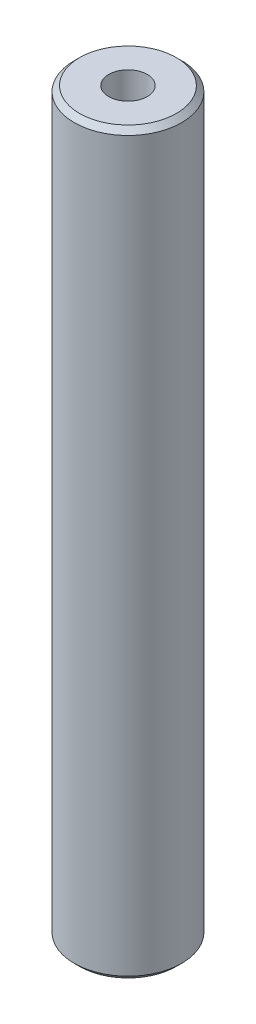
ISO-10303-21;
HEADER;
FILE_DESCRIPTION(('STEP AP214'),'2;1');
FILE_NAME('part.step','',(''),(''),'','','');
FILE_SCHEMA(('AUTOMOTIVE_DESIGN { 1 0 10303 214 1 1 1 1 }'));
ENDSEC;
DATA;
#1=APPLICATION_CONTEXT('core data for automotive mechanical design processes');
#2=APPLICATION_PROTOCOL_DEFINITION('international standard','automotive_design',2000,#1);
#3=PRODUCT_CONTEXT('',#1,'mechanical');
#4=PRODUCT('Part','Part','',(#3));
#5=PRODUCT_RELATED_PRODUCT_CATEGORY('part','',(#4));
#6=PRODUCT_DEFINITION_FORMATION('','',#4);
#7=PRODUCT_DEFINITION_CONTEXT('part definition',#1,'design');
#8=PRODUCT_DEFINITION('design','',#6,#7);
#9=PRODUCT_DEFINITION_SHAPE('','',#8);
#10=(LENGTH_UNIT() NAMED_UNIT(*) SI_UNIT(.MILLI.,.METRE.));
#11=(NAMED_UNIT(*) PLANE_ANGLE_UNIT() SI_UNIT($,.RADIAN.));
#12=(NAMED_UNIT(*) SI_UNIT($,.STERADIAN.) SOLID_ANGLE_UNIT());
#13=UNCERTAINTY_MEASURE_WITH_UNIT(LENGTH_MEASURE(1.E-05),#10,'distance_accuracy_value','');
#14=(GEOMETRIC_REPRESENTATION_CONTEXT(3) GLOBAL_UNCERTAINTY_ASSIGNED_CONTEXT((#13)) GLOBAL_UNIT_ASSIGNED_CONTEXT((#10,
#11,#12)) REPRESENTATION_CONTEXT('',''));
#15=CARTESIAN_POINT('',(0.,0.,0.));
#16=DIRECTION('',(0.,0.,1.));
#17=DIRECTION('',(1.,0.,0.));
#18=AXIS2_PLACEMENT_3D('',#15,#16,#17);
#19=CARTESIAN_POINT('',(0.,240.65770032879,0.));
#20=DIRECTION('',(0.,-1.,0.));
#21=DIRECTION('',(0.,0.,-1.));
#22=AXIS2_PLACEMENT_3D('',#19,#20,#21);
#23=CYLINDRICAL_SURFACE('',#22,17.5);
#24=CARTESIAN_POINT('',(0.,238.927523134323,0.));
#25=DIRECTION('',(0.,1.,0.));
#26=DIRECTION('',(0.,0.,1.));
#27=AXIS2_PLACEMENT_3D('',#24,#25,#26);
#28=CIRCLE('',#27,17.5);
#29=CARTESIAN_POINT('',(0.,238.927523134323,17.5));
#30=VERTEX_POINT('',#29);
#31=EDGE_CURVE('E50',#30,#30,#28,.F.);
#32=ORIENTED_EDGE('',*,*,#31,.T.);
#33=EDGE_LOOP('',(#32));
#34=FACE_BOUND('',#33,.T.);
#35=CARTESIAN_POINT('',(0.,1.73017719446747,0.));
#36=DIRECTION('',(0.,1.,0.));
#37=DIRECTION('',(0.,0.,1.));
#38=AXIS2_PLACEMENT_3D('',#35,#36,#37);
#39=CIRCLE('',#38,17.5);
#40=CARTESIAN_POINT('',(0.,1.73017719446747,17.5));
#41=VERTEX_POINT('',#40);
#42=EDGE_CURVE('E51',#41,#41,#39,.T.);
#43=ORIENTED_EDGE('',*,*,#42,.T.);
#44=EDGE_LOOP('',(#43));
#45=FACE_BOUND('',#44,.T.);
#46=ADVANCED_FACE('F39',(#34,#45),#23,.T.);
#47=CARTESIAN_POINT('',(0.,240.65770032879,0.));
#48=DIRECTION('',(0.,1.,0.));
#49=DIRECTION('',(0.,0.,1.));
#50=AXIS2_PLACEMENT_3D('',#47,#48,#49);
#51=PLANE('',#50);
#52=CARTESIAN_POINT('',(0.,240.65770032879,0.));
#53=DIRECTION('',(0.,1.,0.));
#54=DIRECTION('',(0.,0.,1.));
#55=AXIS2_PLACEMENT_3D('',#52,#53,#54);
#56=CIRCLE('',#55,15.7698228055325);
#57=CARTESIAN_POINT('',(0.,240.65770032879,15.7698228055325));
#58=VERTEX_POINT('',#57);
#59=EDGE_CURVE('E54',#58,#58,#56,.T.);
#60=ORIENTED_EDGE('',*,*,#59,.T.);
#61=EDGE_LOOP('',(#60));
#62=FACE_BOUND('',#61,.T.);
#63=CARTESIAN_POINT('',(0.,240.65770032879,0.));
#64=DIRECTION('',(0.,1.,0.));
#65=DIRECTION('',(0.,0.,1.));
#66=AXIS2_PLACEMENT_3D('',#63,#64,#65);
#67=CIRCLE('',#66,6.27814500208501);
#68=CARTESIAN_POINT('',(0.,240.65770032879,6.27814500208501));
#69=VERTEX_POINT('',#68);
#70=EDGE_CURVE('E58',#69,#69,#67,.T.);
#71=ORIENTED_EDGE('',*,*,#70,.F.);
#72=EDGE_LOOP('',(#71));
#73=FACE_BOUND('',#72,.T.);
#74=ADVANCED_FACE('F69',(#62,#73),#51,.T.);
#75=CARTESIAN_POINT('',(0.,0.,0.));
#76=DIRECTION('',(0.,1.,0.));
#77=DIRECTION('',(0.,0.,1.));
#78=AXIS2_PLACEMENT_3D('',#75,#76,#77);
#79=PLANE('',#78);
#80=CARTESIAN_POINT('',(0.,0.,0.));
#81=DIRECTION('',(0.,1.,0.));
#82=DIRECTION('',(0.,0.,1.));
#83=AXIS2_PLACEMENT_3D('',#80,#81,#82);
#84=CIRCLE('',#83,15.7698228055325);
#85=CARTESIAN_POINT('',(0.,0.,15.7698228055325));
#86=VERTEX_POINT('',#85);
#87=EDGE_CURVE('E10',#86,#86,#84,.F.);
#88=ORIENTED_EDGE('',*,*,#87,.T.);
#89=EDGE_LOOP('',(#88));
#90=FACE_BOUND('',#89,.T.);
#91=CARTESIAN_POINT('',(0.,0.,0.));
#92=DIRECTION('',(0.,1.,0.));
#93=DIRECTION('',(0.,0.,1.));
#94=AXIS2_PLACEMENT_3D('',#91,#92,#93);
#95=CIRCLE('',#94,6.27814500208501);
#96=CARTESIAN_POINT('',(0.,0.,6.27814500208501));
#97=VERTEX_POINT('',#96);
#98=EDGE_CURVE('E63',#97,#97,#95,.T.);
#99=ORIENTED_EDGE('',*,*,#98,.T.);
#100=EDGE_LOOP('',(#99));
#101=FACE_BOUND('',#100,.T.);
#102=ADVANCED_FACE('F75',(#90,#101),#79,.F.);
#103=CARTESIAN_POINT('',(0.,240.65770032879,0.));
#104=DIRECTION('',(0.,-1.,0.));
#105=DIRECTION('',(0.,0.,-1.));
#106=AXIS2_PLACEMENT_3D('',#103,#104,#105);
#107=CYLINDRICAL_SURFACE('',#106,6.27814500208501);
#108=ORIENTED_EDGE('',*,*,#70,.T.);
#109=EDGE_LOOP('',(#108));
#110=FACE_BOUND('',#109,.T.);
#111=ORIENTED_EDGE('',*,*,#98,.F.);
#112=EDGE_LOOP('',(#111));
#113=FACE_BOUND('',#112,.T.);
#114=ADVANCED_FACE('F70',(#110,#113),#107,.F.);
#115=CARTESIAN_POINT('',(0.,240.65770032879,0.));
#116=DIRECTION('',(0.,-1.,0.));
#117=DIRECTION('',(0.,0.,-1.));
#118=AXIS2_PLACEMENT_3D('',#115,#116,#117);
#119=CONICAL_SURFACE('',#118,15.7698228055325,0.785398163397453);
#120=ORIENTED_EDGE('',*,*,#31,.F.);
#121=EDGE_LOOP('',(#120));
#122=FACE_BOUND('',#121,.T.);
#123=ORIENTED_EDGE('',*,*,#59,.F.);
#124=EDGE_LOOP('',(#123));
#125=FACE_BOUND('',#124,.T.);
#126=ADVANCED_FACE('F81',(#122,#125),#119,.T.);
#127=CARTESIAN_POINT('',(0.,1.73017719446747,0.));
#128=DIRECTION('',(0.,1.,0.));
#129=DIRECTION('',(0.,0.,1.));
#130=AXIS2_PLACEMENT_3D('',#127,#128,#129);
#131=CONICAL_SURFACE('',#130,17.5,0.785398163397453);
#132=ORIENTED_EDGE('',*,*,#87,.F.);
#133=EDGE_LOOP('',(#132));
#134=FACE_BOUND('',#133,.T.);
#135=ORIENTED_EDGE('',*,*,#42,.F.);
#136=EDGE_LOOP('',(#135));
#137=FACE_BOUND('',#136,.T.);
#138=ADVANCED_FACE('F45',(#134,#137),#131,.T.);
#139=CLOSED_SHELL('',(#46,#74,#102,#114,#126,#138));
#140=MANIFOLD_SOLID_BREP('B2',#139);
#141=ADVANCED_BREP_SHAPE_REPRESENTATION('',(#18,#140),#14);
#142=SHAPE_DEFINITION_REPRESENTATION(#9,#141);
ENDSEC;
END-ISO-10303-21;
